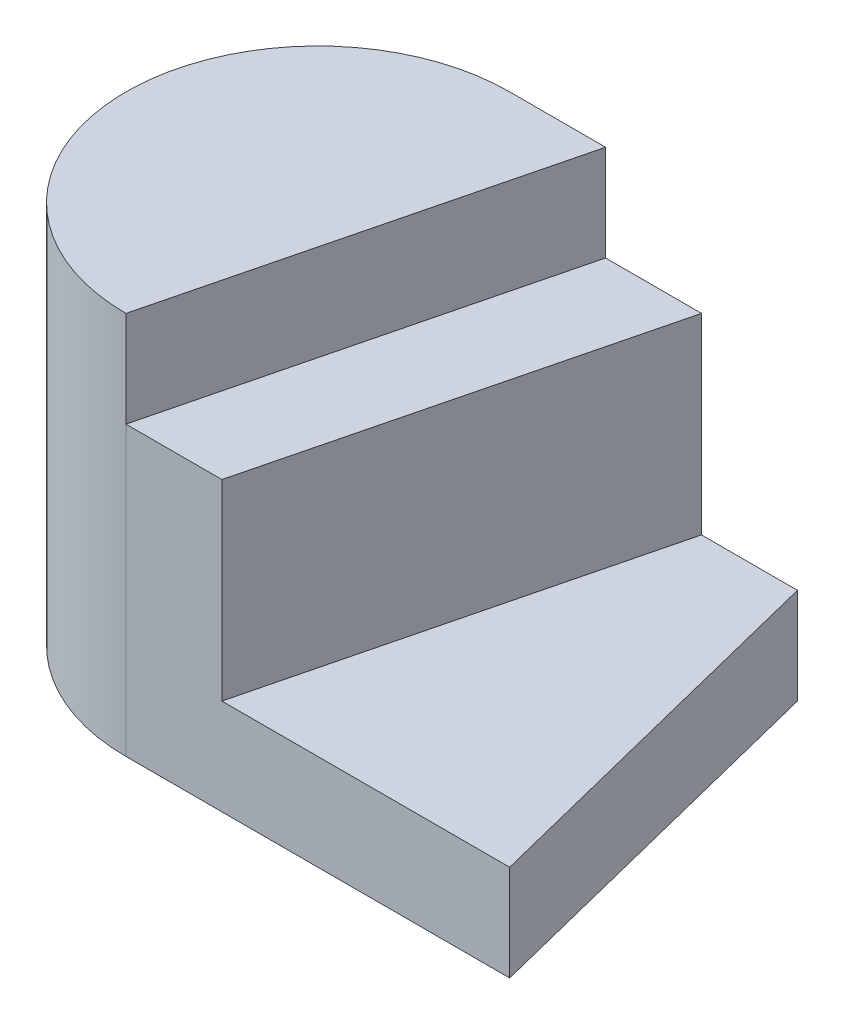
ISO-10303-21;
HEADER;
FILE_DESCRIPTION(('STEP AP214'),'2;1');
FILE_NAME('part.step','',(''),(''),'','','');
FILE_SCHEMA(('AUTOMOTIVE_DESIGN { 1 0 10303 214 1 1 1 1 }'));
ENDSEC;
DATA;
#1=APPLICATION_CONTEXT('core data for automotive mechanical design processes');
#2=APPLICATION_PROTOCOL_DEFINITION('international standard','automotive_design',2000,#1);
#3=PRODUCT_CONTEXT('',#1,'mechanical');
#4=PRODUCT('Part','Part','',(#3));
#5=PRODUCT_RELATED_PRODUCT_CATEGORY('part','',(#4));
#6=PRODUCT_DEFINITION_FORMATION('','',#4);
#7=PRODUCT_DEFINITION_CONTEXT('part definition',#1,'design');
#8=PRODUCT_DEFINITION('design','',#6,#7);
#9=PRODUCT_DEFINITION_SHAPE('','',#8);
#10=(LENGTH_UNIT() NAMED_UNIT(*) SI_UNIT(.MILLI.,.METRE.));
#11=(NAMED_UNIT(*) PLANE_ANGLE_UNIT() SI_UNIT($,.RADIAN.));
#12=(NAMED_UNIT(*) SI_UNIT($,.STERADIAN.) SOLID_ANGLE_UNIT());
#13=UNCERTAINTY_MEASURE_WITH_UNIT(LENGTH_MEASURE(1.E-05),#10,'distance_accuracy_value','');
#14=(GEOMETRIC_REPRESENTATION_CONTEXT(3) GLOBAL_UNCERTAINTY_ASSIGNED_CONTEXT((#13)) GLOBAL_UNIT_ASSIGNED_CONTEXT((#10,
#11,#12)) REPRESENTATION_CONTEXT('',''));
#15=CARTESIAN_POINT('',(0.,0.,0.));
#16=DIRECTION('',(0.,0.,1.));
#17=DIRECTION('',(1.,0.,0.));
#18=AXIS2_PLACEMENT_3D('',#15,#16,#17);
#19=CARTESIAN_POINT('',(1.48029736616688E-13,254.,-508.));
#20=DIRECTION('',(0.,0.,-1.));
#21=DIRECTION('',(-1.,0.,0.));
#22=AXIS2_PLACEMENT_3D('',#19,#20,#21);
#23=PLANE('',#22);
#24=DIRECTION('',(1.,0.,0.));
#25=VECTOR('',#24,1.);
#26=CARTESIAN_POINT('',(1.48029736616688E-13,0.,-508.));
#27=LINE('',#26,#25);
#28=CARTESIAN_POINT('',(0.,0.,-508.));
#29=VERTEX_POINT('',#28);
#30=CARTESIAN_POINT('',(762.,0.,-508.));
#31=VERTEX_POINT('',#30);
#32=EDGE_CURVE('E108',#29,#31,#27,.T.);
#33=ORIENTED_EDGE('',*,*,#32,.F.);
#34=DIRECTION('',(0.,-1.,0.));
#35=VECTOR('',#34,1.);
#36=CARTESIAN_POINT('',(0.,1016.,-508.));
#37=LINE('',#36,#35);
#38=CARTESIAN_POINT('',(0.,1016.,-508.));
#39=VERTEX_POINT('',#38);
#40=EDGE_CURVE('E255',#39,#29,#37,.T.);
#41=ORIENTED_EDGE('',*,*,#40,.F.);
#42=DIRECTION('',(1.,0.,0.));
#43=VECTOR('',#42,1.);
#44=CARTESIAN_POINT('',(1.48029736616688E-13,1016.,-508.));
#45=LINE('',#44,#43);
#46=CARTESIAN_POINT('',(254.,1016.,-508.));
#47=VERTEX_POINT('',#46);
#48=EDGE_CURVE('E234',#39,#47,#45,.T.);
#49=ORIENTED_EDGE('',*,*,#48,.T.);
#50=DIRECTION('',(0.,-1.,0.));
#51=VECTOR('',#50,1.);
#52=CARTESIAN_POINT('',(254.,1016.,-508.));
#53=LINE('',#52,#51);
#54=CARTESIAN_POINT('',(254.,762.,-508.));
#55=VERTEX_POINT('',#54);
#56=EDGE_CURVE('E249',#47,#55,#53,.T.);
#57=ORIENTED_EDGE('',*,*,#56,.T.);
#58=DIRECTION('',(1.,0.,0.));
#59=VECTOR('',#58,1.);
#60=CARTESIAN_POINT('',(1.48029736616688E-13,762.,-508.));
#61=LINE('',#60,#59);
#62=CARTESIAN_POINT('',(508.,762.,-508.));
#63=VERTEX_POINT('',#62);
#64=EDGE_CURVE('E258',#55,#63,#61,.T.);
#65=ORIENTED_EDGE('',*,*,#64,.T.);
#66=DIRECTION('',(0.,-1.,0.));
#67=VECTOR('',#66,1.);
#68=CARTESIAN_POINT('',(508.,762.,-508.));
#69=LINE('',#68,#67);
#70=CARTESIAN_POINT('',(508.,254.,-508.));
#71=VERTEX_POINT('',#70);
#72=EDGE_CURVE('E101',#63,#71,#69,.T.);
#73=ORIENTED_EDGE('',*,*,#72,.T.);
#74=DIRECTION('',(1.,0.,0.));
#75=VECTOR('',#74,1.);
#76=CARTESIAN_POINT('',(1.48029736616688E-13,254.,-508.));
#77=LINE('',#76,#75);
#78=CARTESIAN_POINT('',(762.,254.,-508.));
#79=VERTEX_POINT('',#78);
#80=EDGE_CURVE('E85',#71,#79,#77,.T.);
#81=ORIENTED_EDGE('',*,*,#80,.T.);
#82=DIRECTION('',(0.,-1.,0.));
#83=VECTOR('',#82,1.);
#84=CARTESIAN_POINT('',(762.,254.,-508.));
#85=LINE('',#84,#83);
#86=EDGE_CURVE('E41',#79,#31,#85,.T.);
#87=ORIENTED_EDGE('',*,*,#86,.T.);
#88=EDGE_LOOP('',(#33,#41,#49,#57,#65,#73,#81,#87));
#89=FACE_BOUND('',#88,.T.);
#90=ADVANCED_FACE('F33',(#89),#23,.T.);
#91=CARTESIAN_POINT('',(0.,254.,508.));
#92=DIRECTION('',(0.,0.,1.));
#93=DIRECTION('',(1.,0.,0.));
#94=AXIS2_PLACEMENT_3D('',#91,#92,#93);
#95=PLANE('',#94);
#96=DIRECTION('',(-1.,0.,0.));
#97=VECTOR('',#96,1.);
#98=CARTESIAN_POINT('',(0.,0.,508.));
#99=LINE('',#98,#97);
#100=CARTESIAN_POINT('',(1016.,0.,508.));
#101=VERTEX_POINT('',#100);
#102=CARTESIAN_POINT('',(0.,0.,508.));
#103=VERTEX_POINT('',#102);
#104=EDGE_CURVE('E114',#101,#103,#99,.T.);
#105=ORIENTED_EDGE('',*,*,#104,.F.);
#106=DIRECTION('',(0.,-1.,0.));
#107=VECTOR('',#106,1.);
#108=CARTESIAN_POINT('',(1016.,254.,508.));
#109=LINE('',#108,#107);
#110=CARTESIAN_POINT('',(1016.,254.,508.));
#111=VERTEX_POINT('',#110);
#112=EDGE_CURVE('E11',#111,#101,#109,.T.);
#113=ORIENTED_EDGE('',*,*,#112,.F.);
#114=DIRECTION('',(-1.,0.,0.));
#115=VECTOR('',#114,1.);
#116=CARTESIAN_POINT('',(0.,254.,508.));
#117=LINE('',#116,#115);
#118=CARTESIAN_POINT('',(254.,254.,508.));
#119=VERTEX_POINT('',#118);
#120=EDGE_CURVE('E84',#111,#119,#117,.T.);
#121=ORIENTED_EDGE('',*,*,#120,.T.);
#122=DIRECTION('',(0.,-1.,0.));
#123=VECTOR('',#122,1.);
#124=CARTESIAN_POINT('',(254.,762.,508.));
#125=LINE('',#124,#123);
#126=CARTESIAN_POINT('',(254.,762.,508.));
#127=VERTEX_POINT('',#126);
#128=EDGE_CURVE('E65',#127,#119,#125,.T.);
#129=ORIENTED_EDGE('',*,*,#128,.F.);
#130=DIRECTION('',(-1.,0.,0.));
#131=VECTOR('',#130,1.);
#132=CARTESIAN_POINT('',(0.,762.,508.));
#133=LINE('',#132,#131);
#134=CARTESIAN_POINT('',(0.,762.,508.));
#135=VERTEX_POINT('',#134);
#136=EDGE_CURVE('E98',#127,#135,#133,.T.);
#137=ORIENTED_EDGE('',*,*,#136,.T.);
#138=DIRECTION('',(0.,-1.,0.));
#139=VECTOR('',#138,1.);
#140=CARTESIAN_POINT('',(0.,762.,508.));
#141=LINE('',#140,#139);
#142=EDGE_CURVE('E97',#135,#103,#141,.T.);
#143=ORIENTED_EDGE('',*,*,#142,.T.);
#144=EDGE_LOOP('',(#105,#113,#121,#129,#137,#143));
#145=FACE_BOUND('',#144,.T.);
#146=ADVANCED_FACE('F90',(#145),#95,.T.);
#147=CARTESIAN_POINT('',(836.705882352941,254.,-209.176470588236));
#148=DIRECTION('',(0.970142500145332,0.,-0.242535625036333));
#149=DIRECTION('',(-0.242535625036333,0.,-0.970142500145332));
#150=AXIS2_PLACEMENT_3D('',#147,#148,#149);
#151=PLANE('',#150);
#152=DIRECTION('',(0.242535625036333,0.,0.970142500145332));
#153=VECTOR('',#152,1.);
#154=CARTESIAN_POINT('',(836.705882352941,0.,-209.176470588236));
#155=LINE('',#154,#153);
#156=EDGE_CURVE('E109',#31,#101,#155,.T.);
#157=ORIENTED_EDGE('',*,*,#156,.F.);
#158=ORIENTED_EDGE('',*,*,#86,.F.);
#159=DIRECTION('',(0.242535625036333,0.,0.970142500145332));
#160=VECTOR('',#159,1.);
#161=CARTESIAN_POINT('',(836.705882352941,254.,-209.176470588236));
#162=LINE('',#161,#160);
#163=EDGE_CURVE('E91',#79,#111,#162,.T.);
#164=ORIENTED_EDGE('',*,*,#163,.T.);
#165=ORIENTED_EDGE('',*,*,#112,.T.);
#166=EDGE_LOOP('',(#157,#158,#164,#165));
#167=FACE_BOUND('',#166,.T.);
#168=ADVANCED_FACE('F127',(#167),#151,.T.);
#169=CARTESIAN_POINT('',(0.,254.,0.));
#170=DIRECTION('',(0.,1.,0.));
#171=DIRECTION('',(0.,0.,1.));
#172=AXIS2_PLACEMENT_3D('',#169,#170,#171);
#173=PLANE('',#172);
#174=ORIENTED_EDGE('',*,*,#80,.F.);
#175=DIRECTION('',(-0.242535625036333,0.,0.970142500145332));
#176=VECTOR('',#175,1.);
#177=CARTESIAN_POINT('',(358.588235294118,254.,89.6470588235294));
#178=LINE('',#177,#176);
#179=EDGE_CURVE('E81',#71,#119,#178,.T.);
#180=ORIENTED_EDGE('',*,*,#179,.T.);
#181=ORIENTED_EDGE('',*,*,#120,.F.);
#182=ORIENTED_EDGE('',*,*,#163,.F.);
#183=EDGE_LOOP('',(#174,#180,#181,#182));
#184=FACE_BOUND('',#183,.T.);
#185=ADVANCED_FACE('F82',(#184),#173,.T.);
#186=CARTESIAN_POINT('',(0.,0.,0.));
#187=DIRECTION('',(0.,1.,0.));
#188=DIRECTION('',(0.,0.,1.));
#189=AXIS2_PLACEMENT_3D('',#186,#187,#188);
#190=PLANE('',#189);
#191=ORIENTED_EDGE('',*,*,#32,.T.);
#192=ORIENTED_EDGE('',*,*,#156,.T.);
#193=ORIENTED_EDGE('',*,*,#104,.T.);
#194=CARTESIAN_POINT('',(0.,0.,0.));
#195=DIRECTION('',(0.,1.,0.));
#196=DIRECTION('',(0.,0.,1.));
#197=AXIS2_PLACEMENT_3D('',#194,#195,#196);
#198=CIRCLE('',#197,508.);
#199=EDGE_CURVE('E126',#29,#103,#198,.T.);
#200=ORIENTED_EDGE('',*,*,#199,.F.);
#201=EDGE_LOOP('',(#191,#192,#193,#200));
#202=FACE_BOUND('',#201,.T.);
#203=ADVANCED_FACE('F124',(#202),#190,.F.);
#204=CARTESIAN_POINT('',(358.588235294118,762.,89.6470588235294));
#205=DIRECTION('',(0.970142500145332,0.,0.242535625036333));
#206=DIRECTION('',(0.242535625036333,0.,-0.970142500145332));
#207=AXIS2_PLACEMENT_3D('',#204,#205,#206);
#208=PLANE('',#207);
#209=ORIENTED_EDGE('',*,*,#128,.T.);
#210=ORIENTED_EDGE('',*,*,#179,.F.);
#211=ORIENTED_EDGE('',*,*,#72,.F.);
#212=DIRECTION('',(-0.242535625036333,0.,0.970142500145332));
#213=VECTOR('',#212,1.);
#214=CARTESIAN_POINT('',(358.588235294118,762.,89.6470588235294));
#215=LINE('',#214,#213);
#216=EDGE_CURVE('E95',#63,#127,#215,.T.);
#217=ORIENTED_EDGE('',*,*,#216,.T.);
#218=EDGE_LOOP('',(#209,#210,#211,#217));
#219=FACE_BOUND('',#218,.T.);
#220=ADVANCED_FACE('F93',(#219),#208,.T.);
#221=CARTESIAN_POINT('',(0.,762.,0.));
#222=DIRECTION('',(0.,1.,0.));
#223=DIRECTION('',(0.,0.,1.));
#224=AXIS2_PLACEMENT_3D('',#221,#222,#223);
#225=PLANE('',#224);
#226=ORIENTED_EDGE('',*,*,#216,.F.);
#227=ORIENTED_EDGE('',*,*,#64,.F.);
#228=DIRECTION('',(0.242535625036333,0.,-0.970142500145332));
#229=VECTOR('',#228,1.);
#230=CARTESIAN_POINT('',(119.529411764706,762.,29.8823529411765));
#231=LINE('',#230,#229);
#232=EDGE_CURVE('E103',#135,#55,#231,.T.);
#233=ORIENTED_EDGE('',*,*,#232,.F.);
#234=ORIENTED_EDGE('',*,*,#136,.F.);
#235=EDGE_LOOP('',(#226,#227,#233,#234));
#236=FACE_BOUND('',#235,.T.);
#237=ADVANCED_FACE('F161',(#236),#225,.T.);
#238=CARTESIAN_POINT('',(0.,1016.,0.));
#239=DIRECTION('',(0.,-1.,0.));
#240=DIRECTION('',(0.,0.,-1.));
#241=AXIS2_PLACEMENT_3D('',#238,#239,#240);
#242=CYLINDRICAL_SURFACE('',#241,508.);
#243=ORIENTED_EDGE('',*,*,#199,.T.);
#244=ORIENTED_EDGE('',*,*,#142,.F.);
#245=DIRECTION('',(0.,-1.,0.));
#246=VECTOR('',#245,1.);
#247=CARTESIAN_POINT('',(0.,1016.,508.));
#248=LINE('',#247,#246);
#249=CARTESIAN_POINT('',(0.,1016.,508.));
#250=VERTEX_POINT('',#249);
#251=EDGE_CURVE('E252',#250,#135,#248,.T.);
#252=ORIENTED_EDGE('',*,*,#251,.F.);
#253=CARTESIAN_POINT('',(0.,1016.,0.));
#254=DIRECTION('',(0.,1.,0.));
#255=DIRECTION('',(0.,0.,1.));
#256=AXIS2_PLACEMENT_3D('',#253,#254,#255);
#257=CIRCLE('',#256,508.);
#258=EDGE_CURVE('E237',#39,#250,#257,.T.);
#259=ORIENTED_EDGE('',*,*,#258,.F.);
#260=ORIENTED_EDGE('',*,*,#40,.T.);
#261=EDGE_LOOP('',(#243,#244,#252,#259,#260));
#262=FACE_BOUND('',#261,.T.);
#263=ADVANCED_FACE('F166',(#262),#242,.T.);
#264=CARTESIAN_POINT('',(119.529411764706,1016.,29.8823529411765));
#265=DIRECTION('',(-0.970142500145332,0.,-0.242535625036333));
#266=DIRECTION('',(-0.242535625036333,0.,0.970142500145332));
#267=AXIS2_PLACEMENT_3D('',#264,#265,#266);
#268=PLANE('',#267);
#269=ORIENTED_EDGE('',*,*,#232,.T.);
#270=ORIENTED_EDGE('',*,*,#56,.F.);
#271=DIRECTION('',(0.242535625036333,0.,-0.970142500145332));
#272=VECTOR('',#271,1.);
#273=CARTESIAN_POINT('',(119.529411764706,1016.,29.8823529411765));
#274=LINE('',#273,#272);
#275=EDGE_CURVE('E241',#250,#47,#274,.T.);
#276=ORIENTED_EDGE('',*,*,#275,.F.);
#277=ORIENTED_EDGE('',*,*,#251,.T.);
#278=EDGE_LOOP('',(#269,#270,#276,#277));
#279=FACE_BOUND('',#278,.T.);
#280=ADVANCED_FACE('F176',(#279),#268,.F.);
#281=CARTESIAN_POINT('',(0.,1016.,0.));
#282=DIRECTION('',(0.,1.,0.));
#283=DIRECTION('',(0.,0.,1.));
#284=AXIS2_PLACEMENT_3D('',#281,#282,#283);
#285=PLANE('',#284);
#286=ORIENTED_EDGE('',*,*,#48,.F.);
#287=ORIENTED_EDGE('',*,*,#258,.T.);
#288=ORIENTED_EDGE('',*,*,#275,.T.);
#289=EDGE_LOOP('',(#286,#287,#288));
#290=FACE_BOUND('',#289,.T.);
#291=ADVANCED_FACE('F186',(#290),#285,.T.);
#292=CLOSED_SHELL('',(#90,#146,#168,#185,#203,#220,#237,#263,#280,#291));
#293=MANIFOLD_SOLID_BREP('B2',#292);
#294=ADVANCED_BREP_SHAPE_REPRESENTATION('',(#18,#293),#14);
#295=SHAPE_DEFINITION_REPRESENTATION(#9,#294);
ENDSEC;
END-ISO-10303-21;
